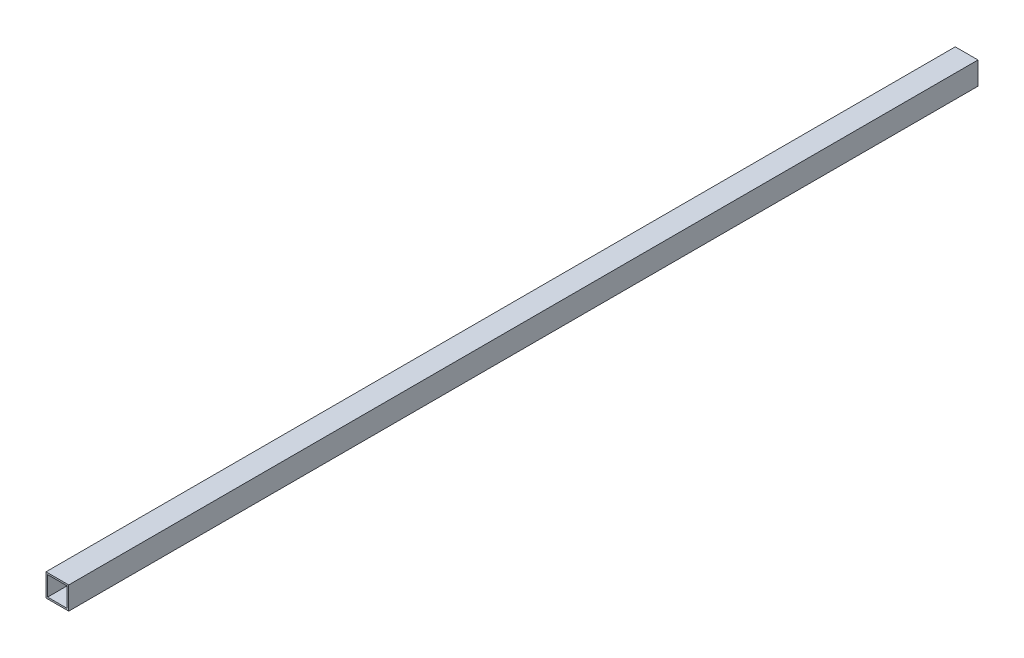
ISO-10303-21;
HEADER;
FILE_DESCRIPTION(('STEP AP214'),'2;1');
FILE_NAME('part.step','',(''),(''),'','','');
FILE_SCHEMA(('AUTOMOTIVE_DESIGN { 1 0 10303 214 1 1 1 1 }'));
ENDSEC;
DATA;
#1=APPLICATION_CONTEXT('core data for automotive mechanical design processes');
#2=APPLICATION_PROTOCOL_DEFINITION('international standard','automotive_design',2000,#1);
#3=PRODUCT_CONTEXT('',#1,'mechanical');
#4=PRODUCT('Part','Part','',(#3));
#5=PRODUCT_RELATED_PRODUCT_CATEGORY('part','',(#4));
#6=PRODUCT_DEFINITION_FORMATION('','',#4);
#7=PRODUCT_DEFINITION_CONTEXT('part definition',#1,'design');
#8=PRODUCT_DEFINITION('design','',#6,#7);
#9=PRODUCT_DEFINITION_SHAPE('','',#8);
#10=(LENGTH_UNIT() NAMED_UNIT(*) SI_UNIT(.MILLI.,.METRE.));
#11=(NAMED_UNIT(*) PLANE_ANGLE_UNIT() SI_UNIT($,.RADIAN.));
#12=(NAMED_UNIT(*) SI_UNIT($,.STERADIAN.) SOLID_ANGLE_UNIT());
#13=UNCERTAINTY_MEASURE_WITH_UNIT(LENGTH_MEASURE(1.E-05),#10,'distance_accuracy_value','');
#14=(GEOMETRIC_REPRESENTATION_CONTEXT(3) GLOBAL_UNCERTAINTY_ASSIGNED_CONTEXT((#13)) GLOBAL_UNIT_ASSIGNED_CONTEXT((#10,
#11,#12)) REPRESENTATION_CONTEXT('',''));
#15=CARTESIAN_POINT('',(0.,0.,0.));
#16=DIRECTION('',(0.,0.,1.));
#17=DIRECTION('',(1.,0.,0.));
#18=AXIS2_PLACEMENT_3D('',#15,#16,#17);
#19=CARTESIAN_POINT('',(0.,0.,1778.));
#20=DIRECTION('',(0.,0.,-1.));
#21=DIRECTION('',(-1.,0.,0.));
#22=AXIS2_PLACEMENT_3D('',#19,#20,#21);
#23=PLANE('',#22);
#24=DIRECTION('',(0.,-1.,0.));
#25=VECTOR('',#24,1.);
#26=CARTESIAN_POINT('',(0.,0.,1778.));
#27=LINE('',#26,#25);
#28=CARTESIAN_POINT('',(0.,44.45,1778.));
#29=VERTEX_POINT('',#28);
#30=CARTESIAN_POINT('',(0.,0.,1778.));
#31=VERTEX_POINT('',#30);
#32=EDGE_CURVE('E134',#29,#31,#27,.T.);
#33=ORIENTED_EDGE('',*,*,#32,.T.);
#34=DIRECTION('',(1.,0.,0.));
#35=VECTOR('',#34,1.);
#36=CARTESIAN_POINT('',(0.,0.,1778.));
#37=LINE('',#36,#35);
#38=CARTESIAN_POINT('',(44.45,0.,1778.));
#39=VERTEX_POINT('',#38);
#40=EDGE_CURVE('E137',#31,#39,#37,.T.);
#41=ORIENTED_EDGE('',*,*,#40,.T.);
#42=DIRECTION('',(0.,1.,0.));
#43=VECTOR('',#42,1.);
#44=CARTESIAN_POINT('',(44.45,0.,1778.));
#45=LINE('',#44,#43);
#46=CARTESIAN_POINT('',(44.45,44.45,1778.));
#47=VERTEX_POINT('',#46);
#48=EDGE_CURVE('E140',#39,#47,#45,.T.);
#49=ORIENTED_EDGE('',*,*,#48,.T.);
#50=DIRECTION('',(-1.,0.,0.));
#51=VECTOR('',#50,1.);
#52=CARTESIAN_POINT('',(0.,44.45,1778.));
#53=LINE('',#52,#51);
#54=EDGE_CURVE('E142',#47,#29,#53,.T.);
#55=ORIENTED_EDGE('',*,*,#54,.T.);
#56=EDGE_LOOP('',(#33,#41,#49,#55));
#57=FACE_BOUND('',#56,.T.);
#58=DIRECTION('',(0.,-1.,0.));
#59=VECTOR('',#58,1.);
#60=CARTESIAN_POINT('',(3.175,3.175,1778.));
#61=LINE('',#60,#59);
#62=CARTESIAN_POINT('',(3.175,41.275,1778.));
#63=VERTEX_POINT('',#62);
#64=CARTESIAN_POINT('',(3.175,3.175,1778.));
#65=VERTEX_POINT('',#64);
#66=EDGE_CURVE('E98',#63,#65,#61,.T.);
#67=ORIENTED_EDGE('',*,*,#66,.F.);
#68=DIRECTION('',(-1.,0.,0.));
#69=VECTOR('',#68,1.);
#70=CARTESIAN_POINT('',(3.175,41.275,1778.));
#71=LINE('',#70,#69);
#72=CARTESIAN_POINT('',(41.275,41.275,1778.));
#73=VERTEX_POINT('',#72);
#74=EDGE_CURVE('E120',#73,#63,#71,.T.);
#75=ORIENTED_EDGE('',*,*,#74,.F.);
#76=DIRECTION('',(0.,1.,0.));
#77=VECTOR('',#76,1.);
#78=CARTESIAN_POINT('',(41.275,3.175,1778.));
#79=LINE('',#78,#77);
#80=CARTESIAN_POINT('',(41.275,3.175,1778.));
#81=VERTEX_POINT('',#80);
#82=EDGE_CURVE('E118',#81,#73,#79,.T.);
#83=ORIENTED_EDGE('',*,*,#82,.F.);
#84=DIRECTION('',(1.,0.,0.));
#85=VECTOR('',#84,1.);
#86=CARTESIAN_POINT('',(3.175,3.175,1778.));
#87=LINE('',#86,#85);
#88=EDGE_CURVE('E106',#65,#81,#87,.T.);
#89=ORIENTED_EDGE('',*,*,#88,.F.);
#90=EDGE_LOOP('',(#67,#75,#83,#89));
#91=FACE_BOUND('',#90,.T.);
#92=ADVANCED_FACE('F33',(#57,#91),#23,.F.);
#93=CARTESIAN_POINT('',(0.,0.,0.));
#94=DIRECTION('',(0.,0.,-1.));
#95=DIRECTION('',(-1.,0.,0.));
#96=AXIS2_PLACEMENT_3D('',#93,#94,#95);
#97=PLANE('',#96);
#98=DIRECTION('',(0.,-1.,0.));
#99=VECTOR('',#98,1.);
#100=CARTESIAN_POINT('',(0.,0.,0.));
#101=LINE('',#100,#99);
#102=CARTESIAN_POINT('',(0.,44.45,0.));
#103=VERTEX_POINT('',#102);
#104=CARTESIAN_POINT('',(0.,0.,0.));
#105=VERTEX_POINT('',#104);
#106=EDGE_CURVE('E114',#103,#105,#101,.T.);
#107=ORIENTED_EDGE('',*,*,#106,.F.);
#108=DIRECTION('',(-1.,0.,0.));
#109=VECTOR('',#108,1.);
#110=CARTESIAN_POINT('',(0.,44.45,0.));
#111=LINE('',#110,#109);
#112=CARTESIAN_POINT('',(44.45,44.45,0.));
#113=VERTEX_POINT('',#112);
#114=EDGE_CURVE('E138',#113,#103,#111,.T.);
#115=ORIENTED_EDGE('',*,*,#114,.F.);
#116=DIRECTION('',(0.,1.,0.));
#117=VECTOR('',#116,1.);
#118=CARTESIAN_POINT('',(44.45,0.,0.));
#119=LINE('',#118,#117);
#120=CARTESIAN_POINT('',(44.45,0.,0.));
#121=VERTEX_POINT('',#120);
#122=EDGE_CURVE('E149',#121,#113,#119,.T.);
#123=ORIENTED_EDGE('',*,*,#122,.F.);
#124=DIRECTION('',(1.,0.,0.));
#125=VECTOR('',#124,1.);
#126=CARTESIAN_POINT('',(0.,0.,0.));
#127=LINE('',#126,#125);
#128=EDGE_CURVE('E147',#105,#121,#127,.T.);
#129=ORIENTED_EDGE('',*,*,#128,.F.);
#130=EDGE_LOOP('',(#107,#115,#123,#129));
#131=FACE_BOUND('',#130,.T.);
#132=DIRECTION('',(-1.,0.,0.));
#133=VECTOR('',#132,1.);
#134=CARTESIAN_POINT('',(3.175,41.275,0.));
#135=LINE('',#134,#133);
#136=CARTESIAN_POINT('',(41.275,41.275,0.));
#137=VERTEX_POINT('',#136);
#138=CARTESIAN_POINT('',(3.175,41.275,0.));
#139=VERTEX_POINT('',#138);
#140=EDGE_CURVE('E107',#137,#139,#135,.T.);
#141=ORIENTED_EDGE('',*,*,#140,.T.);
#142=DIRECTION('',(0.,-1.,0.));
#143=VECTOR('',#142,1.);
#144=CARTESIAN_POINT('',(3.175,3.175,0.));
#145=LINE('',#144,#143);
#146=CARTESIAN_POINT('',(3.175,3.175,0.));
#147=VERTEX_POINT('',#146);
#148=EDGE_CURVE('E56',#139,#147,#145,.T.);
#149=ORIENTED_EDGE('',*,*,#148,.T.);
#150=DIRECTION('',(1.,0.,0.));
#151=VECTOR('',#150,1.);
#152=CARTESIAN_POINT('',(3.175,3.175,0.));
#153=LINE('',#152,#151);
#154=CARTESIAN_POINT('',(41.275,3.175,0.));
#155=VERTEX_POINT('',#154);
#156=EDGE_CURVE('E113',#147,#155,#153,.T.);
#157=ORIENTED_EDGE('',*,*,#156,.T.);
#158=DIRECTION('',(0.,1.,0.));
#159=VECTOR('',#158,1.);
#160=CARTESIAN_POINT('',(41.275,3.175,0.));
#161=LINE('',#160,#159);
#162=EDGE_CURVE('E126',#155,#137,#161,.T.);
#163=ORIENTED_EDGE('',*,*,#162,.T.);
#164=EDGE_LOOP('',(#141,#149,#157,#163));
#165=FACE_BOUND('',#164,.T.);
#166=ADVANCED_FACE('F167',(#131,#165),#97,.T.);
#167=CARTESIAN_POINT('',(0.,0.,1778.));
#168=DIRECTION('',(1.,0.,0.));
#169=DIRECTION('',(0.,0.,-1.));
#170=AXIS2_PLACEMENT_3D('',#167,#168,#169);
#171=PLANE('',#170);
#172=ORIENTED_EDGE('',*,*,#106,.T.);
#173=DIRECTION('',(0.,0.,-1.));
#174=VECTOR('',#173,1.);
#175=CARTESIAN_POINT('',(0.,0.,1778.));
#176=LINE('',#175,#174);
#177=EDGE_CURVE('E11',#31,#105,#176,.T.);
#178=ORIENTED_EDGE('',*,*,#177,.F.);
#179=ORIENTED_EDGE('',*,*,#32,.F.);
#180=DIRECTION('',(0.,0.,-1.));
#181=VECTOR('',#180,1.);
#182=CARTESIAN_POINT('',(0.,44.45,1778.));
#183=LINE('',#182,#181);
#184=EDGE_CURVE('E144',#29,#103,#183,.T.);
#185=ORIENTED_EDGE('',*,*,#184,.T.);
#186=EDGE_LOOP('',(#172,#178,#179,#185));
#187=FACE_BOUND('',#186,.T.);
#188=ADVANCED_FACE('F35',(#187),#171,.F.);
#189=CARTESIAN_POINT('',(0.,0.,1778.));
#190=DIRECTION('',(0.,1.,0.));
#191=DIRECTION('',(0.,0.,1.));
#192=AXIS2_PLACEMENT_3D('',#189,#190,#191);
#193=PLANE('',#192);
#194=ORIENTED_EDGE('',*,*,#128,.T.);
#195=DIRECTION('',(0.,0.,-1.));
#196=VECTOR('',#195,1.);
#197=CARTESIAN_POINT('',(44.45,0.,1778.));
#198=LINE('',#197,#196);
#199=EDGE_CURVE('E41',#39,#121,#198,.T.);
#200=ORIENTED_EDGE('',*,*,#199,.F.);
#201=ORIENTED_EDGE('',*,*,#40,.F.);
#202=ORIENTED_EDGE('',*,*,#177,.T.);
#203=EDGE_LOOP('',(#194,#200,#201,#202));
#204=FACE_BOUND('',#203,.T.);
#205=ADVANCED_FACE('F177',(#204),#193,.F.);
#206=CARTESIAN_POINT('',(44.45,0.,1778.));
#207=DIRECTION('',(-1.,0.,0.));
#208=DIRECTION('',(0.,0.,1.));
#209=AXIS2_PLACEMENT_3D('',#206,#207,#208);
#210=PLANE('',#209);
#211=ORIENTED_EDGE('',*,*,#122,.T.);
#212=DIRECTION('',(0.,0.,-1.));
#213=VECTOR('',#212,1.);
#214=CARTESIAN_POINT('',(44.45,44.45,1778.));
#215=LINE('',#214,#213);
#216=EDGE_CURVE('E154',#47,#113,#215,.T.);
#217=ORIENTED_EDGE('',*,*,#216,.F.);
#218=ORIENTED_EDGE('',*,*,#48,.F.);
#219=ORIENTED_EDGE('',*,*,#199,.T.);
#220=EDGE_LOOP('',(#211,#217,#218,#219));
#221=FACE_BOUND('',#220,.T.);
#222=ADVANCED_FACE('F161',(#221),#210,.F.);
#223=CARTESIAN_POINT('',(0.,44.45,1778.));
#224=DIRECTION('',(0.,-1.,0.));
#225=DIRECTION('',(0.,0.,-1.));
#226=AXIS2_PLACEMENT_3D('',#223,#224,#225);
#227=PLANE('',#226);
#228=ORIENTED_EDGE('',*,*,#114,.T.);
#229=ORIENTED_EDGE('',*,*,#184,.F.);
#230=ORIENTED_EDGE('',*,*,#54,.F.);
#231=ORIENTED_EDGE('',*,*,#216,.T.);
#232=EDGE_LOOP('',(#228,#229,#230,#231));
#233=FACE_BOUND('',#232,.T.);
#234=ADVANCED_FACE('F171',(#233),#227,.F.);
#235=CARTESIAN_POINT('',(3.175,3.175,1778.));
#236=DIRECTION('',(1.,0.,0.));
#237=DIRECTION('',(0.,0.,-1.));
#238=AXIS2_PLACEMENT_3D('',#235,#236,#237);
#239=PLANE('',#238);
#240=ORIENTED_EDGE('',*,*,#148,.F.);
#241=DIRECTION('',(0.,0.,-1.));
#242=VECTOR('',#241,1.);
#243=CARTESIAN_POINT('',(3.175,41.275,1778.));
#244=LINE('',#243,#242);
#245=EDGE_CURVE('E102',#63,#139,#244,.T.);
#246=ORIENTED_EDGE('',*,*,#245,.F.);
#247=ORIENTED_EDGE('',*,*,#66,.T.);
#248=DIRECTION('',(0.,0.,-1.));
#249=VECTOR('',#248,1.);
#250=CARTESIAN_POINT('',(3.175,3.175,1778.));
#251=LINE('',#250,#249);
#252=EDGE_CURVE('E101',#65,#147,#251,.T.);
#253=ORIENTED_EDGE('',*,*,#252,.T.);
#254=EDGE_LOOP('',(#240,#246,#247,#253));
#255=FACE_BOUND('',#254,.T.);
#256=ADVANCED_FACE('F100',(#255),#239,.T.);
#257=CARTESIAN_POINT('',(3.175,3.175,1778.));
#258=DIRECTION('',(0.,1.,0.));
#259=DIRECTION('',(0.,0.,1.));
#260=AXIS2_PLACEMENT_3D('',#257,#258,#259);
#261=PLANE('',#260);
#262=ORIENTED_EDGE('',*,*,#156,.F.);
#263=ORIENTED_EDGE('',*,*,#252,.F.);
#264=ORIENTED_EDGE('',*,*,#88,.T.);
#265=DIRECTION('',(0.,0.,-1.));
#266=VECTOR('',#265,1.);
#267=CARTESIAN_POINT('',(41.275,3.175,1778.));
#268=LINE('',#267,#266);
#269=EDGE_CURVE('E115',#81,#155,#268,.T.);
#270=ORIENTED_EDGE('',*,*,#269,.T.);
#271=EDGE_LOOP('',(#262,#263,#264,#270));
#272=FACE_BOUND('',#271,.T.);
#273=ADVANCED_FACE('F110',(#272),#261,.T.);
#274=CARTESIAN_POINT('',(41.275,3.175,1778.));
#275=DIRECTION('',(-1.,0.,0.));
#276=DIRECTION('',(0.,0.,1.));
#277=AXIS2_PLACEMENT_3D('',#274,#275,#276);
#278=PLANE('',#277);
#279=ORIENTED_EDGE('',*,*,#162,.F.);
#280=ORIENTED_EDGE('',*,*,#269,.F.);
#281=ORIENTED_EDGE('',*,*,#82,.T.);
#282=DIRECTION('',(0.,0.,-1.));
#283=VECTOR('',#282,1.);
#284=CARTESIAN_POINT('',(41.275,41.275,1778.));
#285=LINE('',#284,#283);
#286=EDGE_CURVE('E48',#73,#137,#285,.T.);
#287=ORIENTED_EDGE('',*,*,#286,.T.);
#288=EDGE_LOOP('',(#279,#280,#281,#287));
#289=FACE_BOUND('',#288,.T.);
#290=ADVANCED_FACE('F200',(#289),#278,.T.);
#291=CARTESIAN_POINT('',(3.175,41.275,1778.));
#292=DIRECTION('',(0.,-1.,0.));
#293=DIRECTION('',(0.,0.,-1.));
#294=AXIS2_PLACEMENT_3D('',#291,#292,#293);
#295=PLANE('',#294);
#296=ORIENTED_EDGE('',*,*,#140,.F.);
#297=ORIENTED_EDGE('',*,*,#286,.F.);
#298=ORIENTED_EDGE('',*,*,#74,.T.);
#299=ORIENTED_EDGE('',*,*,#245,.T.);
#300=EDGE_LOOP('',(#296,#297,#298,#299));
#301=FACE_BOUND('',#300,.T.);
#302=ADVANCED_FACE('F204',(#301),#295,.T.);
#303=CLOSED_SHELL('',(#92,#166,#188,#205,#222,#234,#256,#273,#290,#302));
#304=MANIFOLD_SOLID_BREP('B2',#303);
#305=ADVANCED_BREP_SHAPE_REPRESENTATION('',(#18,#304),#14);
#306=SHAPE_DEFINITION_REPRESENTATION(#9,#305);
ENDSEC;
END-ISO-10303-21;
